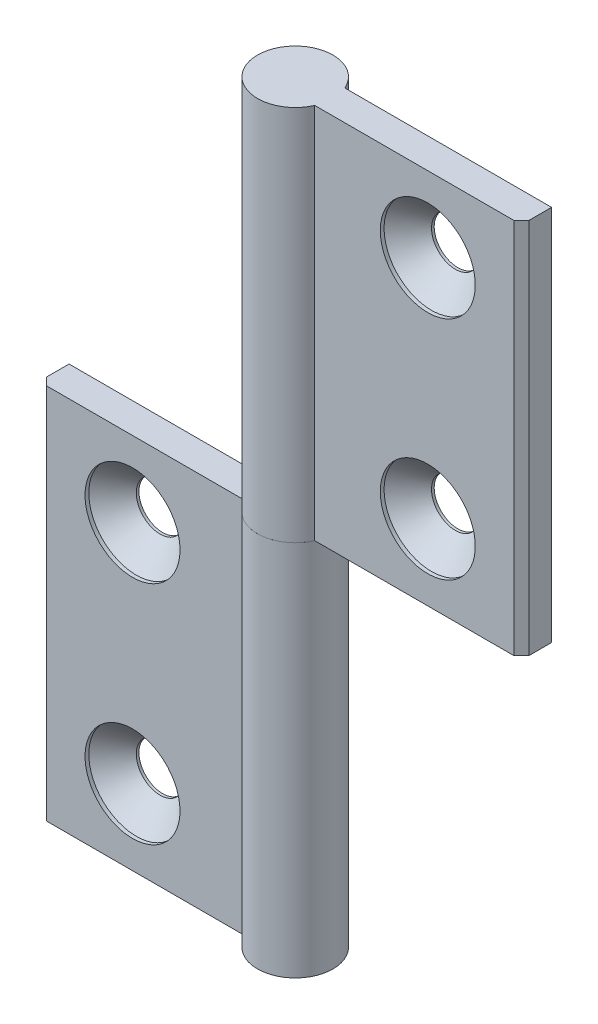
ISO-10303-21;
HEADER;
FILE_DESCRIPTION(('STEP AP214'),'2;1');
FILE_NAME('part.step','',(''),(''),'','','');
FILE_SCHEMA(('AUTOMOTIVE_DESIGN { 1 0 10303 214 1 1 1 1 }'));
ENDSEC;
DATA;
#1=APPLICATION_CONTEXT('core data for automotive mechanical design processes');
#2=APPLICATION_PROTOCOL_DEFINITION('international standard','automotive_design',2000,#1);
#3=PRODUCT_CONTEXT('',#1,'mechanical');
#4=PRODUCT('Part','Part','',(#3));
#5=PRODUCT_RELATED_PRODUCT_CATEGORY('part','',(#4));
#6=PRODUCT_DEFINITION_FORMATION('','',#4);
#7=PRODUCT_DEFINITION_CONTEXT('part definition',#1,'design');
#8=PRODUCT_DEFINITION('design','',#6,#7);
#9=PRODUCT_DEFINITION_SHAPE('','',#8);
#10=(LENGTH_UNIT() NAMED_UNIT(*) SI_UNIT(.MILLI.,.METRE.));
#11=(NAMED_UNIT(*) PLANE_ANGLE_UNIT() SI_UNIT($,.RADIAN.));
#12=(NAMED_UNIT(*) SI_UNIT($,.STERADIAN.) SOLID_ANGLE_UNIT());
#13=UNCERTAINTY_MEASURE_WITH_UNIT(LENGTH_MEASURE(1.E-05),#10,'distance_accuracy_value','');
#14=(GEOMETRIC_REPRESENTATION_CONTEXT(3) GLOBAL_UNCERTAINTY_ASSIGNED_CONTEXT((#13)) GLOBAL_UNIT_ASSIGNED_CONTEXT((#10,
#11,#12)) REPRESENTATION_CONTEXT('',''));
#15=CARTESIAN_POINT('',(0.,0.,0.));
#16=DIRECTION('',(0.,0.,1.));
#17=DIRECTION('',(1.,0.,0.));
#18=AXIS2_PLACEMENT_3D('',#15,#16,#17);
#19=CARTESIAN_POINT('',(0.,25.,0.));
#20=DIRECTION('',(0.,1.,0.));
#21=DIRECTION('',(0.,0.,-1.));
#22=AXIS2_PLACEMENT_3D('',#19,#20,#21);
#23=CYLINDRICAL_SURFACE('',#22,5.);
#24=CARTESIAN_POINT('',(0.,75.,0.));
#25=DIRECTION('',(0.,-1.,0.));
#26=DIRECTION('',(0.,0.,1.));
#27=AXIS2_PLACEMENT_3D('',#24,#25,#26);
#28=CIRCLE('',#27,5.);
#29=CARTESIAN_POINT('',(4.58257569495585,75.,1.99999999999997));
#30=VERTEX_POINT('',#29);
#31=CARTESIAN_POINT('',(4.58257569495582,75.,-2.00000000000004));
#32=VERTEX_POINT('',#31);
#33=EDGE_CURVE('E120',#30,#32,#28,.T.);
#34=ORIENTED_EDGE('',*,*,#33,.T.);
#35=DIRECTION('',(0.,1.,0.));
#36=VECTOR('',#35,1.);
#37=CARTESIAN_POINT('',(4.58257569495582,25.,-2.00000000000004));
#38=LINE('',#37,#36);
#39=CARTESIAN_POINT('',(4.58257569495582,25.,-2.00000000000004));
#40=VERTEX_POINT('',#39);
#41=EDGE_CURVE('E12',#40,#32,#38,.T.);
#42=ORIENTED_EDGE('',*,*,#41,.F.);
#43=CARTESIAN_POINT('',(0.,25.,0.));
#44=DIRECTION('',(0.,-1.,0.));
#45=DIRECTION('',(0.,0.,1.));
#46=AXIS2_PLACEMENT_3D('',#43,#44,#45);
#47=CIRCLE('',#46,5.);
#48=CARTESIAN_POINT('',(4.58257569495585,25.,1.99999999999997));
#49=VERTEX_POINT('',#48);
#50=EDGE_CURVE('E129',#49,#40,#47,.T.);
#51=ORIENTED_EDGE('',*,*,#50,.F.);
#52=DIRECTION('',(0.,1.,0.));
#53=VECTOR('',#52,1.);
#54=CARTESIAN_POINT('',(4.58257569495585,25.,1.99999999999997));
#55=LINE('',#54,#53);
#56=EDGE_CURVE('E116',#49,#30,#55,.T.);
#57=ORIENTED_EDGE('',*,*,#56,.T.);
#58=EDGE_LOOP('',(#34,#42,#51,#57));
#59=FACE_BOUND('',#58,.T.);
#60=ADVANCED_FACE('F44',(#59),#23,.T.);
#61=CARTESIAN_POINT('',(4.58257569495582,25.,-2.00000000000004));
#62=DIRECTION('',(0.,0.,1.));
#63=DIRECTION('',(-1.,0.,0.));
#64=AXIS2_PLACEMENT_3D('',#61,#62,#63);
#65=PLANE('',#64);
#66=CARTESIAN_POINT('',(19.5825756949558,35.,-2.00000000000014));
#67=DIRECTION('',(0.,0.,1.));
#68=DIRECTION('',(-1.,0.,0.));
#69=AXIS2_PLACEMENT_3D('',#66,#67,#68);
#70=CIRCLE('',#69,3.15);
#71=CARTESIAN_POINT('',(16.4325756949558,35.,-2.00000000000012));
#72=VERTEX_POINT('',#71);
#73=EDGE_CURVE('E47',#72,#72,#70,.T.);
#74=ORIENTED_EDGE('',*,*,#73,.T.);
#75=EDGE_LOOP('',(#74));
#76=FACE_BOUND('',#75,.T.);
#77=CARTESIAN_POINT('',(19.5825756949558,65.,-2.00000000000014));
#78=DIRECTION('',(0.,0.,1.));
#79=DIRECTION('',(-1.,0.,0.));
#80=AXIS2_PLACEMENT_3D('',#77,#78,#79);
#81=CIRCLE('',#80,3.15);
#82=CARTESIAN_POINT('',(16.4325756949558,65.,-2.00000000000012));
#83=VERTEX_POINT('',#82);
#84=EDGE_CURVE('E124',#83,#83,#81,.T.);
#85=ORIENTED_EDGE('',*,*,#84,.T.);
#86=EDGE_LOOP('',(#85));
#87=FACE_BOUND('',#86,.T.);
#88=DIRECTION('',(1.,0.,0.));
#89=VECTOR('',#88,1.);
#90=CARTESIAN_POINT('',(4.58257569495582,75.,-2.00000000000004));
#91=LINE('',#90,#89);
#92=CARTESIAN_POINT('',(32.,75.,-2.00000000000023));
#93=VERTEX_POINT('',#92);
#94=EDGE_CURVE('E123',#32,#93,#91,.T.);
#95=ORIENTED_EDGE('',*,*,#94,.T.);
#96=DIRECTION('',(0.,1.,0.));
#97=VECTOR('',#96,1.);
#98=CARTESIAN_POINT('',(32.,25.,-2.00000000000023));
#99=LINE('',#98,#97);
#100=CARTESIAN_POINT('',(32.,25.,-2.00000000000023));
#101=VERTEX_POINT('',#100);
#102=EDGE_CURVE('E53',#101,#93,#99,.T.);
#103=ORIENTED_EDGE('',*,*,#102,.F.);
#104=DIRECTION('',(1.,0.,0.));
#105=VECTOR('',#104,1.);
#106=CARTESIAN_POINT('',(4.58257569495582,25.,-2.00000000000004));
#107=LINE('',#106,#105);
#108=EDGE_CURVE('E96',#40,#101,#107,.T.);
#109=ORIENTED_EDGE('',*,*,#108,.F.);
#110=ORIENTED_EDGE('',*,*,#41,.T.);
#111=EDGE_LOOP('',(#95,#103,#109,#110));
#112=FACE_BOUND('',#111,.T.);
#113=ADVANCED_FACE('F150',(#76,#87,#112),#65,.F.);
#114=CARTESIAN_POINT('',(32.,25.,-2.00000000000023));
#115=DIRECTION('',(-1.,0.,0.));
#116=DIRECTION('',(0.,0.,-1.));
#117=AXIS2_PLACEMENT_3D('',#114,#115,#116);
#118=PLANE('',#117);
#119=DIRECTION('',(0.,0.,1.));
#120=VECTOR('',#119,1.);
#121=CARTESIAN_POINT('',(32.,75.,-2.00000000000023));
#122=LINE('',#121,#120);
#123=CARTESIAN_POINT('',(32.,75.,0.999999999999765));
#124=VERTEX_POINT('',#123);
#125=EDGE_CURVE('E111',#93,#124,#122,.T.);
#126=ORIENTED_EDGE('',*,*,#125,.T.);
#127=DIRECTION('',(0.,1.,0.));
#128=VECTOR('',#127,1.);
#129=CARTESIAN_POINT('',(32.,25.,0.999999999999765));
#130=LINE('',#129,#128);
#131=CARTESIAN_POINT('',(32.,25.,0.999999999999765));
#132=VERTEX_POINT('',#131);
#133=EDGE_CURVE('E108',#132,#124,#130,.T.);
#134=ORIENTED_EDGE('',*,*,#133,.F.);
#135=DIRECTION('',(0.,0.,1.));
#136=VECTOR('',#135,1.);
#137=CARTESIAN_POINT('',(32.,25.,-2.00000000000023));
#138=LINE('',#137,#136);
#139=EDGE_CURVE('E100',#101,#132,#138,.T.);
#140=ORIENTED_EDGE('',*,*,#139,.F.);
#141=ORIENTED_EDGE('',*,*,#102,.T.);
#142=EDGE_LOOP('',(#126,#134,#140,#141));
#143=FACE_BOUND('',#142,.T.);
#144=ADVANCED_FACE('F109',(#143),#118,.F.);
#145=CARTESIAN_POINT('',(32.,25.,0.999999999999765));
#146=DIRECTION('',(-0.707106781186547,0.,-0.707106781186548));
#147=DIRECTION('',(0.707106781186548,0.,-0.707106781186547));
#148=AXIS2_PLACEMENT_3D('',#145,#146,#147);
#149=PLANE('',#148);
#150=DIRECTION('',(-0.707106781186548,0.,0.707106781186547));
#151=VECTOR('',#150,1.);
#152=CARTESIAN_POINT('',(32.,75.,0.999999999999765));
#153=LINE('',#152,#151);
#154=CARTESIAN_POINT('',(31.,75.,1.99999999999977));
#155=VERTEX_POINT('',#154);
#156=EDGE_CURVE('E82',#124,#155,#153,.T.);
#157=ORIENTED_EDGE('',*,*,#156,.T.);
#158=DIRECTION('',(0.,1.,0.));
#159=VECTOR('',#158,1.);
#160=CARTESIAN_POINT('',(31.,25.,1.99999999999977));
#161=LINE('',#160,#159);
#162=CARTESIAN_POINT('',(31.,25.,1.99999999999977));
#163=VERTEX_POINT('',#162);
#164=EDGE_CURVE('E112',#163,#155,#161,.T.);
#165=ORIENTED_EDGE('',*,*,#164,.F.);
#166=DIRECTION('',(-0.707106781186548,0.,0.707106781186547));
#167=VECTOR('',#166,1.);
#168=CARTESIAN_POINT('',(32.,25.,0.999999999999765));
#169=LINE('',#168,#167);
#170=EDGE_CURVE('E104',#132,#163,#169,.T.);
#171=ORIENTED_EDGE('',*,*,#170,.F.);
#172=ORIENTED_EDGE('',*,*,#133,.T.);
#173=EDGE_LOOP('',(#157,#165,#171,#172));
#174=FACE_BOUND('',#173,.T.);
#175=ADVANCED_FACE('F114',(#174),#149,.F.);
#176=CARTESIAN_POINT('',(31.,25.,1.99999999999977));
#177=DIRECTION('',(0.,0.,-1.));
#178=DIRECTION('',(1.,0.,0.));
#179=AXIS2_PLACEMENT_3D('',#176,#177,#178);
#180=PLANE('',#179);
#181=CARTESIAN_POINT('',(19.5825756949558,35.,1.99999999999986));
#182=DIRECTION('',(0.,0.,1.));
#183=DIRECTION('',(-1.,0.,0.));
#184=AXIS2_PLACEMENT_3D('',#181,#182,#183);
#185=CIRCLE('',#184,6.3);
#186=CARTESIAN_POINT('',(13.2825756949559,35.,1.9999999999999));
#187=VERTEX_POINT('',#186);
#188=EDGE_CURVE('E184',#187,#187,#185,.T.);
#189=ORIENTED_EDGE('',*,*,#188,.F.);
#190=EDGE_LOOP('',(#189));
#191=FACE_BOUND('',#190,.T.);
#192=CARTESIAN_POINT('',(19.5825756949558,65.,1.99999999999986));
#193=DIRECTION('',(0.,0.,1.));
#194=DIRECTION('',(-1.,0.,0.));
#195=AXIS2_PLACEMENT_3D('',#192,#193,#194);
#196=CIRCLE('',#195,6.3);
#197=CARTESIAN_POINT('',(13.2825756949559,65.,1.9999999999999));
#198=VERTEX_POINT('',#197);
#199=EDGE_CURVE('E142',#198,#198,#196,.T.);
#200=ORIENTED_EDGE('',*,*,#199,.F.);
#201=EDGE_LOOP('',(#200));
#202=FACE_BOUND('',#201,.T.);
#203=DIRECTION('',(-1.,0.,0.));
#204=VECTOR('',#203,1.);
#205=CARTESIAN_POINT('',(31.,75.,1.99999999999977));
#206=LINE('',#205,#204);
#207=EDGE_CURVE('E88',#155,#30,#206,.T.);
#208=ORIENTED_EDGE('',*,*,#207,.T.);
#209=ORIENTED_EDGE('',*,*,#56,.F.);
#210=DIRECTION('',(-1.,0.,0.));
#211=VECTOR('',#210,1.);
#212=CARTESIAN_POINT('',(31.,25.,1.99999999999977));
#213=LINE('',#212,#211);
#214=EDGE_CURVE('E62',#163,#49,#213,.T.);
#215=ORIENTED_EDGE('',*,*,#214,.F.);
#216=ORIENTED_EDGE('',*,*,#164,.T.);
#217=EDGE_LOOP('',(#208,#209,#215,#216));
#218=FACE_BOUND('',#217,.T.);
#219=ADVANCED_FACE('F162',(#191,#202,#218),#180,.F.);
#220=CARTESIAN_POINT('',(0.,25.,0.));
#221=DIRECTION('',(0.,-1.,0.));
#222=DIRECTION('',(0.,0.,1.));
#223=AXIS2_PLACEMENT_3D('',#220,#221,#222);
#224=PLANE('',#223);
#225=ORIENTED_EDGE('',*,*,#50,.T.);
#226=ORIENTED_EDGE('',*,*,#108,.T.);
#227=ORIENTED_EDGE('',*,*,#139,.T.);
#228=ORIENTED_EDGE('',*,*,#170,.T.);
#229=ORIENTED_EDGE('',*,*,#214,.T.);
#230=EDGE_LOOP('',(#225,#226,#227,#228,#229));
#231=FACE_BOUND('',#230,.T.);
#232=ADVANCED_FACE('F102',(#231),#224,.T.);
#233=CARTESIAN_POINT('',(0.,75.,0.));
#234=DIRECTION('',(0.,-1.,0.));
#235=DIRECTION('',(0.,0.,1.));
#236=AXIS2_PLACEMENT_3D('',#233,#234,#235);
#237=PLANE('',#236);
#238=ORIENTED_EDGE('',*,*,#33,.F.);
#239=ORIENTED_EDGE('',*,*,#207,.F.);
#240=ORIENTED_EDGE('',*,*,#156,.F.);
#241=ORIENTED_EDGE('',*,*,#125,.F.);
#242=ORIENTED_EDGE('',*,*,#94,.F.);
#243=EDGE_LOOP('',(#238,#239,#240,#241,#242));
#244=FACE_BOUND('',#243,.T.);
#245=ADVANCED_FACE('F152',(#244),#237,.F.);
#246=CARTESIAN_POINT('',(19.5825756949558,65.,1.99999999999986));
#247=DIRECTION('',(0.,0.,1.));
#248=DIRECTION('',(-1.,0.,0.));
#249=AXIS2_PLACEMENT_3D('',#246,#247,#248);
#250=CYLINDRICAL_SURFACE('',#249,3.15);
#251=CARTESIAN_POINT('',(19.5825756949558,65.,-1.65000000000014));
#252=DIRECTION('',(0.,0.,1.));
#253=DIRECTION('',(-1.,0.,0.));
#254=AXIS2_PLACEMENT_3D('',#251,#252,#253);
#255=CIRCLE('',#254,3.15);
#256=CARTESIAN_POINT('',(16.4325756949558,65.,-1.65000000000012));
#257=VERTEX_POINT('',#256);
#258=EDGE_CURVE('E133',#257,#257,#255,.T.);
#259=ORIENTED_EDGE('',*,*,#258,.T.);
#260=EDGE_LOOP('',(#259));
#261=FACE_BOUND('',#260,.T.);
#262=ORIENTED_EDGE('',*,*,#84,.F.);
#263=EDGE_LOOP('',(#262));
#264=FACE_BOUND('',#263,.T.);
#265=ADVANCED_FACE('F154',(#261,#264),#250,.F.);
#266=CARTESIAN_POINT('',(19.5825756949558,65.,1.49999999999986));
#267=DIRECTION('',(0.,0.,1.));
#268=DIRECTION('',(-1.,0.,0.));
#269=AXIS2_PLACEMENT_3D('',#266,#267,#268);
#270=CONICAL_SURFACE('',#269,6.3,0.785398163397449);
#271=ORIENTED_EDGE('',*,*,#258,.F.);
#272=EDGE_LOOP('',(#271));
#273=FACE_BOUND('',#272,.T.);
#274=CARTESIAN_POINT('',(19.5825756949558,65.,1.49999999999986));
#275=DIRECTION('',(0.,0.,1.));
#276=DIRECTION('',(-1.,0.,0.));
#277=AXIS2_PLACEMENT_3D('',#274,#275,#276);
#278=CIRCLE('',#277,6.3);
#279=CARTESIAN_POINT('',(13.2825756949558,65.,1.4999999999999));
#280=VERTEX_POINT('',#279);
#281=EDGE_CURVE('E137',#280,#280,#278,.T.);
#282=ORIENTED_EDGE('',*,*,#281,.T.);
#283=EDGE_LOOP('',(#282));
#284=FACE_BOUND('',#283,.T.);
#285=ADVANCED_FACE('F160',(#273,#284),#270,.F.);
#286=CARTESIAN_POINT('',(19.5825756949558,65.,1.99999999999986));
#287=DIRECTION('',(0.,0.,1.));
#288=DIRECTION('',(-1.,0.,0.));
#289=AXIS2_PLACEMENT_3D('',#286,#287,#288);
#290=CYLINDRICAL_SURFACE('',#289,6.3);
#291=ORIENTED_EDGE('',*,*,#281,.F.);
#292=EDGE_LOOP('',(#291));
#293=FACE_BOUND('',#292,.T.);
#294=ORIENTED_EDGE('',*,*,#199,.T.);
#295=EDGE_LOOP('',(#294));
#296=FACE_BOUND('',#295,.T.);
#297=ADVANCED_FACE('F211',(#293,#296),#290,.F.);
#298=CARTESIAN_POINT('',(19.5825756949558,35.,1.99999999999986));
#299=DIRECTION('',(0.,0.,1.));
#300=DIRECTION('',(-1.,0.,0.));
#301=AXIS2_PLACEMENT_3D('',#298,#299,#300);
#302=CYLINDRICAL_SURFACE('',#301,3.15);
#303=CARTESIAN_POINT('',(19.5825756949558,35.,-1.65000000000014));
#304=DIRECTION('',(0.,0.,1.));
#305=DIRECTION('',(-1.,0.,0.));
#306=AXIS2_PLACEMENT_3D('',#303,#304,#305);
#307=CIRCLE('',#306,3.15);
#308=CARTESIAN_POINT('',(16.4325756949558,35.,-1.65000000000012));
#309=VERTEX_POINT('',#308);
#310=EDGE_CURVE('E188',#309,#309,#307,.T.);
#311=ORIENTED_EDGE('',*,*,#310,.T.);
#312=EDGE_LOOP('',(#311));
#313=FACE_BOUND('',#312,.T.);
#314=ORIENTED_EDGE('',*,*,#73,.F.);
#315=EDGE_LOOP('',(#314));
#316=FACE_BOUND('',#315,.T.);
#317=ADVANCED_FACE('F204',(#313,#316),#302,.F.);
#318=CARTESIAN_POINT('',(19.5825756949558,35.,1.49999999999986));
#319=DIRECTION('',(0.,0.,1.));
#320=DIRECTION('',(-1.,0.,0.));
#321=AXIS2_PLACEMENT_3D('',#318,#319,#320);
#322=CONICAL_SURFACE('',#321,6.3,0.785398163397449);
#323=ORIENTED_EDGE('',*,*,#310,.F.);
#324=EDGE_LOOP('',(#323));
#325=FACE_BOUND('',#324,.T.);
#326=CARTESIAN_POINT('',(19.5825756949558,35.,1.49999999999986));
#327=DIRECTION('',(0.,0.,1.));
#328=DIRECTION('',(-1.,0.,0.));
#329=AXIS2_PLACEMENT_3D('',#326,#327,#328);
#330=CIRCLE('',#329,6.3);
#331=CARTESIAN_POINT('',(13.2825756949558,35.,1.4999999999999));
#332=VERTEX_POINT('',#331);
#333=EDGE_CURVE('E192',#332,#332,#330,.T.);
#334=ORIENTED_EDGE('',*,*,#333,.T.);
#335=EDGE_LOOP('',(#334));
#336=FACE_BOUND('',#335,.T.);
#337=ADVANCED_FACE('F198',(#325,#336),#322,.F.);
#338=CARTESIAN_POINT('',(19.5825756949558,35.,1.99999999999986));
#339=DIRECTION('',(0.,0.,1.));
#340=DIRECTION('',(-1.,0.,0.));
#341=AXIS2_PLACEMENT_3D('',#338,#339,#340);
#342=CYLINDRICAL_SURFACE('',#341,6.3);
#343=ORIENTED_EDGE('',*,*,#333,.F.);
#344=EDGE_LOOP('',(#343));
#345=FACE_BOUND('',#344,.T.);
#346=ORIENTED_EDGE('',*,*,#188,.T.);
#347=EDGE_LOOP('',(#346));
#348=FACE_BOUND('',#347,.T.);
#349=ADVANCED_FACE('F196',(#345,#348),#342,.F.);
#350=CLOSED_SHELL('',(#60,#113,#144,#175,#219,#232,#245,#265,#285,#297,#317,#337,#349));
#351=MANIFOLD_SOLID_BREP('B2',#350);
#352=CARTESIAN_POINT('',(0.,25.,0.));
#353=DIRECTION('',(0.,-1.,0.));
#354=DIRECTION('',(0.,0.,-1.));
#355=AXIS2_PLACEMENT_3D('',#352,#353,#354);
#356=CYLINDRICAL_SURFACE('',#355,5.);
#357=CARTESIAN_POINT('',(0.,-25.,0.));
#358=DIRECTION('',(0.,1.,0.));
#359=DIRECTION('',(0.,0.,1.));
#360=AXIS2_PLACEMENT_3D('',#357,#358,#359);
#361=CIRCLE('',#360,5.);
#362=CARTESIAN_POINT('',(-4.58257569495584,-25.,2.));
#363=VERTEX_POINT('',#362);
#364=CARTESIAN_POINT('',(-4.58257569495584,-25.,-2.));
#365=VERTEX_POINT('',#364);
#366=EDGE_CURVE('E371',#363,#365,#361,.T.);
#367=ORIENTED_EDGE('',*,*,#366,.T.);
#368=DIRECTION('',(0.,-1.,0.));
#369=VECTOR('',#368,1.);
#370=CARTESIAN_POINT('',(-4.58257569495584,25.,-2.));
#371=LINE('',#370,#369);
#372=CARTESIAN_POINT('',(-4.58257569495584,25.,-2.));
#373=VERTEX_POINT('',#372);
#374=EDGE_CURVE('E42',#373,#365,#371,.T.);
#375=ORIENTED_EDGE('',*,*,#374,.F.);
#376=CARTESIAN_POINT('',(0.,25.,0.));
#377=DIRECTION('',(0.,1.,0.));
#378=DIRECTION('',(0.,0.,1.));
#379=AXIS2_PLACEMENT_3D('',#376,#377,#378);
#380=CIRCLE('',#379,5.);
#381=CARTESIAN_POINT('',(-4.58257569495584,25.,2.));
#382=VERTEX_POINT('',#381);
#383=EDGE_CURVE('E380',#382,#373,#380,.T.);
#384=ORIENTED_EDGE('',*,*,#383,.F.);
#385=DIRECTION('',(0.,-1.,0.));
#386=VECTOR('',#385,1.);
#387=CARTESIAN_POINT('',(-4.58257569495584,25.,2.));
#388=LINE('',#387,#386);
#389=EDGE_CURVE('E367',#382,#363,#388,.T.);
#390=ORIENTED_EDGE('',*,*,#389,.T.);
#391=EDGE_LOOP('',(#367,#375,#384,#390));
#392=FACE_BOUND('',#391,.T.);
#393=ADVANCED_FACE('F295',(#392),#356,.T.);
#394=CARTESIAN_POINT('',(-4.58257569495584,25.,-2.));
#395=DIRECTION('',(0.,0.,1.));
#396=DIRECTION('',(1.,0.,0.));
#397=AXIS2_PLACEMENT_3D('',#394,#395,#396);
#398=PLANE('',#397);
#399=CARTESIAN_POINT('',(-19.5825756949558,15.,-2.));
#400=DIRECTION('',(0.,0.,1.));
#401=DIRECTION('',(1.,0.,0.));
#402=AXIS2_PLACEMENT_3D('',#399,#400,#401);
#403=CIRCLE('',#402,3.15);
#404=CARTESIAN_POINT('',(-16.4325756949558,15.,-2.));
#405=VERTEX_POINT('',#404);
#406=EDGE_CURVE('E298',#405,#405,#403,.T.);
#407=ORIENTED_EDGE('',*,*,#406,.T.);
#408=EDGE_LOOP('',(#407));
#409=FACE_BOUND('',#408,.T.);
#410=CARTESIAN_POINT('',(-19.5825756949558,-15.,-2.));
#411=DIRECTION('',(0.,0.,1.));
#412=DIRECTION('',(1.,0.,0.));
#413=AXIS2_PLACEMENT_3D('',#410,#411,#412);
#414=CIRCLE('',#413,3.15);
#415=CARTESIAN_POINT('',(-16.4325756949558,-15.,-2.));
#416=VERTEX_POINT('',#415);
#417=EDGE_CURVE('E375',#416,#416,#414,.T.);
#418=ORIENTED_EDGE('',*,*,#417,.T.);
#419=EDGE_LOOP('',(#418));
#420=FACE_BOUND('',#419,.T.);
#421=DIRECTION('',(-1.,0.,0.));
#422=VECTOR('',#421,1.);
#423=CARTESIAN_POINT('',(-4.58257569495584,-25.,-2.));
#424=LINE('',#423,#422);
#425=CARTESIAN_POINT('',(-32.,-25.,-2.));
#426=VERTEX_POINT('',#425);
#427=EDGE_CURVE('E374',#365,#426,#424,.T.);
#428=ORIENTED_EDGE('',*,*,#427,.T.);
#429=DIRECTION('',(0.,-1.,0.));
#430=VECTOR('',#429,1.);
#431=CARTESIAN_POINT('',(-32.,25.,-2.));
#432=LINE('',#431,#430);
#433=CARTESIAN_POINT('',(-32.,25.,-2.));
#434=VERTEX_POINT('',#433);
#435=EDGE_CURVE('E304',#434,#426,#432,.T.);
#436=ORIENTED_EDGE('',*,*,#435,.F.);
#437=DIRECTION('',(-1.,0.,0.));
#438=VECTOR('',#437,1.);
#439=CARTESIAN_POINT('',(-4.58257569495584,25.,-2.));
#440=LINE('',#439,#438);
#441=EDGE_CURVE('E347',#373,#434,#440,.T.);
#442=ORIENTED_EDGE('',*,*,#441,.F.);
#443=ORIENTED_EDGE('',*,*,#374,.T.);
#444=EDGE_LOOP('',(#428,#436,#442,#443));
#445=FACE_BOUND('',#444,.T.);
#446=ADVANCED_FACE('F401',(#409,#420,#445),#398,.F.);
#447=CARTESIAN_POINT('',(-32.,25.,-2.));
#448=DIRECTION('',(1.,0.,0.));
#449=DIRECTION('',(0.,0.,-1.));
#450=AXIS2_PLACEMENT_3D('',#447,#448,#449);
#451=PLANE('',#450);
#452=DIRECTION('',(0.,0.,1.));
#453=VECTOR('',#452,1.);
#454=CARTESIAN_POINT('',(-32.,-25.,-2.));
#455=LINE('',#454,#453);
#456=CARTESIAN_POINT('',(-32.,-25.,1.));
#457=VERTEX_POINT('',#456);
#458=EDGE_CURVE('E362',#426,#457,#455,.T.);
#459=ORIENTED_EDGE('',*,*,#458,.T.);
#460=DIRECTION('',(0.,-1.,0.));
#461=VECTOR('',#460,1.);
#462=CARTESIAN_POINT('',(-32.,25.,1.));
#463=LINE('',#462,#461);
#464=CARTESIAN_POINT('',(-32.,25.,1.));
#465=VERTEX_POINT('',#464);
#466=EDGE_CURVE('E359',#465,#457,#463,.T.);
#467=ORIENTED_EDGE('',*,*,#466,.F.);
#468=DIRECTION('',(0.,0.,1.));
#469=VECTOR('',#468,1.);
#470=CARTESIAN_POINT('',(-32.,25.,-2.));
#471=LINE('',#470,#469);
#472=EDGE_CURVE('E351',#434,#465,#471,.T.);
#473=ORIENTED_EDGE('',*,*,#472,.F.);
#474=ORIENTED_EDGE('',*,*,#435,.T.);
#475=EDGE_LOOP('',(#459,#467,#473,#474));
#476=FACE_BOUND('',#475,.T.);
#477=ADVANCED_FACE('F360',(#476),#451,.F.);
#478=CARTESIAN_POINT('',(-32.,25.,1.));
#479=DIRECTION('',(0.707106781186542,0.,-0.707106781186553));
#480=DIRECTION('',(-0.707106781186553,0.,-0.707106781186542));
#481=AXIS2_PLACEMENT_3D('',#478,#479,#480);
#482=PLANE('',#481);
#483=DIRECTION('',(0.707106781186553,0.,0.707106781186542));
#484=VECTOR('',#483,1.);
#485=CARTESIAN_POINT('',(-32.,-25.,1.));
#486=LINE('',#485,#484);
#487=CARTESIAN_POINT('',(-31.,-25.,2.));
#488=VERTEX_POINT('',#487);
#489=EDGE_CURVE('E333',#457,#488,#486,.T.);
#490=ORIENTED_EDGE('',*,*,#489,.T.);
#491=DIRECTION('',(0.,-1.,0.));
#492=VECTOR('',#491,1.);
#493=CARTESIAN_POINT('',(-31.,25.,2.));
#494=LINE('',#493,#492);
#495=CARTESIAN_POINT('',(-31.,25.,2.));
#496=VERTEX_POINT('',#495);
#497=EDGE_CURVE('E363',#496,#488,#494,.T.);
#498=ORIENTED_EDGE('',*,*,#497,.F.);
#499=DIRECTION('',(0.707106781186553,0.,0.707106781186542));
#500=VECTOR('',#499,1.);
#501=CARTESIAN_POINT('',(-32.,25.,1.));
#502=LINE('',#501,#500);
#503=EDGE_CURVE('E355',#465,#496,#502,.T.);
#504=ORIENTED_EDGE('',*,*,#503,.F.);
#505=ORIENTED_EDGE('',*,*,#466,.T.);
#506=EDGE_LOOP('',(#490,#498,#504,#505));
#507=FACE_BOUND('',#506,.T.);
#508=ADVANCED_FACE('F365',(#507),#482,.F.);
#509=CARTESIAN_POINT('',(-31.,25.,2.));
#510=DIRECTION('',(0.,0.,-1.));
#511=DIRECTION('',(-1.,0.,0.));
#512=AXIS2_PLACEMENT_3D('',#509,#510,#511);
#513=PLANE('',#512);
#514=CARTESIAN_POINT('',(-19.5825756949558,15.,2.));
#515=DIRECTION('',(0.,0.,1.));
#516=DIRECTION('',(1.,0.,0.));
#517=AXIS2_PLACEMENT_3D('',#514,#515,#516);
#518=CIRCLE('',#517,6.3);
#519=CARTESIAN_POINT('',(-13.2825756949558,15.,2.));
#520=VERTEX_POINT('',#519);
#521=EDGE_CURVE('E435',#520,#520,#518,.T.);
#522=ORIENTED_EDGE('',*,*,#521,.F.);
#523=EDGE_LOOP('',(#522));
#524=FACE_BOUND('',#523,.T.);
#525=CARTESIAN_POINT('',(-19.5825756949558,-15.,2.));
#526=DIRECTION('',(0.,0.,1.));
#527=DIRECTION('',(1.,0.,0.));
#528=AXIS2_PLACEMENT_3D('',#525,#526,#527);
#529=CIRCLE('',#528,6.3);
#530=CARTESIAN_POINT('',(-13.2825756949558,-15.,2.));
#531=VERTEX_POINT('',#530);
#532=EDGE_CURVE('E393',#531,#531,#529,.T.);
#533=ORIENTED_EDGE('',*,*,#532,.F.);
#534=EDGE_LOOP('',(#533));
#535=FACE_BOUND('',#534,.T.);
#536=DIRECTION('',(1.,0.,0.));
#537=VECTOR('',#536,1.);
#538=CARTESIAN_POINT('',(-31.,-25.,2.));
#539=LINE('',#538,#537);
#540=EDGE_CURVE('E339',#488,#363,#539,.T.);
#541=ORIENTED_EDGE('',*,*,#540,.T.);
#542=ORIENTED_EDGE('',*,*,#389,.F.);
#543=DIRECTION('',(1.,0.,0.));
#544=VECTOR('',#543,1.);
#545=CARTESIAN_POINT('',(-31.,25.,2.));
#546=LINE('',#545,#544);
#547=EDGE_CURVE('E313',#496,#382,#546,.T.);
#548=ORIENTED_EDGE('',*,*,#547,.F.);
#549=ORIENTED_EDGE('',*,*,#497,.T.);
#550=EDGE_LOOP('',(#541,#542,#548,#549));
#551=FACE_BOUND('',#550,.T.);
#552=ADVANCED_FACE('F413',(#524,#535,#551),#513,.F.);
#553=CARTESIAN_POINT('',(0.,25.,0.));
#554=DIRECTION('',(0.,1.,0.));
#555=DIRECTION('',(0.,0.,1.));
#556=AXIS2_PLACEMENT_3D('',#553,#554,#555);
#557=PLANE('',#556);
#558=ORIENTED_EDGE('',*,*,#383,.T.);
#559=ORIENTED_EDGE('',*,*,#441,.T.);
#560=ORIENTED_EDGE('',*,*,#472,.T.);
#561=ORIENTED_EDGE('',*,*,#503,.T.);
#562=ORIENTED_EDGE('',*,*,#547,.T.);
#563=EDGE_LOOP('',(#558,#559,#560,#561,#562));
#564=FACE_BOUND('',#563,.T.);
#565=ADVANCED_FACE('F353',(#564),#557,.T.);
#566=CARTESIAN_POINT('',(0.,-25.,0.));
#567=DIRECTION('',(0.,1.,0.));
#568=DIRECTION('',(0.,0.,1.));
#569=AXIS2_PLACEMENT_3D('',#566,#567,#568);
#570=PLANE('',#569);
#571=ORIENTED_EDGE('',*,*,#366,.F.);
#572=ORIENTED_EDGE('',*,*,#540,.F.);
#573=ORIENTED_EDGE('',*,*,#489,.F.);
#574=ORIENTED_EDGE('',*,*,#458,.F.);
#575=ORIENTED_EDGE('',*,*,#427,.F.);
#576=EDGE_LOOP('',(#571,#572,#573,#574,#575));
#577=FACE_BOUND('',#576,.T.);
#578=ADVANCED_FACE('F403',(#577),#570,.F.);
#579=CARTESIAN_POINT('',(-19.5825756949558,-15.,2.));
#580=DIRECTION('',(0.,0.,1.));
#581=DIRECTION('',(1.,0.,0.));
#582=AXIS2_PLACEMENT_3D('',#579,#580,#581);
#583=CYLINDRICAL_SURFACE('',#582,3.15);
#584=CARTESIAN_POINT('',(-19.5825756949558,-15.,-1.65));
#585=DIRECTION('',(0.,0.,1.));
#586=DIRECTION('',(1.,0.,0.));
#587=AXIS2_PLACEMENT_3D('',#584,#585,#586);
#588=CIRCLE('',#587,3.15);
#589=CARTESIAN_POINT('',(-16.4325756949558,-15.,-1.65));
#590=VERTEX_POINT('',#589);
#591=EDGE_CURVE('E384',#590,#590,#588,.T.);
#592=ORIENTED_EDGE('',*,*,#591,.T.);
#593=EDGE_LOOP('',(#592));
#594=FACE_BOUND('',#593,.T.);
#595=ORIENTED_EDGE('',*,*,#417,.F.);
#596=EDGE_LOOP('',(#595));
#597=FACE_BOUND('',#596,.T.);
#598=ADVANCED_FACE('F405',(#594,#597),#583,.F.);
#599=CARTESIAN_POINT('',(-19.5825756949558,-15.,1.5));
#600=DIRECTION('',(0.,0.,1.));
#601=DIRECTION('',(1.,0.,0.));
#602=AXIS2_PLACEMENT_3D('',#599,#600,#601);
#603=CONICAL_SURFACE('',#602,6.3,0.785398163397449);
#604=ORIENTED_EDGE('',*,*,#591,.F.);
#605=EDGE_LOOP('',(#604));
#606=FACE_BOUND('',#605,.T.);
#607=CARTESIAN_POINT('',(-19.5825756949558,-15.,1.5));
#608=DIRECTION('',(0.,0.,1.));
#609=DIRECTION('',(1.,0.,0.));
#610=AXIS2_PLACEMENT_3D('',#607,#608,#609);
#611=CIRCLE('',#610,6.3);
#612=CARTESIAN_POINT('',(-13.2825756949558,-15.,1.5));
#613=VERTEX_POINT('',#612);
#614=EDGE_CURVE('E388',#613,#613,#611,.T.);
#615=ORIENTED_EDGE('',*,*,#614,.T.);
#616=EDGE_LOOP('',(#615));
#617=FACE_BOUND('',#616,.T.);
#618=ADVANCED_FACE('F411',(#606,#617),#603,.F.);
#619=CARTESIAN_POINT('',(-19.5825756949558,-15.,2.));
#620=DIRECTION('',(0.,0.,1.));
#621=DIRECTION('',(1.,0.,0.));
#622=AXIS2_PLACEMENT_3D('',#619,#620,#621);
#623=CYLINDRICAL_SURFACE('',#622,6.3);
#624=ORIENTED_EDGE('',*,*,#614,.F.);
#625=EDGE_LOOP('',(#624));
#626=FACE_BOUND('',#625,.T.);
#627=ORIENTED_EDGE('',*,*,#532,.T.);
#628=EDGE_LOOP('',(#627));
#629=FACE_BOUND('',#628,.T.);
#630=ADVANCED_FACE('F462',(#626,#629),#623,.F.);
#631=CARTESIAN_POINT('',(-19.5825756949558,15.,2.));
#632=DIRECTION('',(0.,0.,1.));
#633=DIRECTION('',(1.,0.,0.));
#634=AXIS2_PLACEMENT_3D('',#631,#632,#633);
#635=CYLINDRICAL_SURFACE('',#634,3.15);
#636=CARTESIAN_POINT('',(-19.5825756949558,15.,-1.65));
#637=DIRECTION('',(0.,0.,1.));
#638=DIRECTION('',(1.,0.,0.));
#639=AXIS2_PLACEMENT_3D('',#636,#637,#638);
#640=CIRCLE('',#639,3.15);
#641=CARTESIAN_POINT('',(-16.4325756949558,15.,-1.65));
#642=VERTEX_POINT('',#641);
#643=EDGE_CURVE('E439',#642,#642,#640,.T.);
#644=ORIENTED_EDGE('',*,*,#643,.T.);
#645=EDGE_LOOP('',(#644));
#646=FACE_BOUND('',#645,.T.);
#647=ORIENTED_EDGE('',*,*,#406,.F.);
#648=EDGE_LOOP('',(#647));
#649=FACE_BOUND('',#648,.T.);
#650=ADVANCED_FACE('F455',(#646,#649),#635,.F.);
#651=CARTESIAN_POINT('',(-19.5825756949558,15.,1.5));
#652=DIRECTION('',(0.,0.,1.));
#653=DIRECTION('',(1.,0.,0.));
#654=AXIS2_PLACEMENT_3D('',#651,#652,#653);
#655=CONICAL_SURFACE('',#654,6.3,0.785398163397449);
#656=ORIENTED_EDGE('',*,*,#643,.F.);
#657=EDGE_LOOP('',(#656));
#658=FACE_BOUND('',#657,.T.);
#659=CARTESIAN_POINT('',(-19.5825756949558,15.,1.5));
#660=DIRECTION('',(0.,0.,1.));
#661=DIRECTION('',(1.,0.,0.));
#662=AXIS2_PLACEMENT_3D('',#659,#660,#661);
#663=CIRCLE('',#662,6.3);
#664=CARTESIAN_POINT('',(-13.2825756949558,15.,1.5));
#665=VERTEX_POINT('',#664);
#666=EDGE_CURVE('E443',#665,#665,#663,.T.);
#667=ORIENTED_EDGE('',*,*,#666,.T.);
#668=EDGE_LOOP('',(#667));
#669=FACE_BOUND('',#668,.T.);
#670=ADVANCED_FACE('F449',(#658,#669),#655,.F.);
#671=CARTESIAN_POINT('',(-19.5825756949558,15.,2.));
#672=DIRECTION('',(0.,0.,1.));
#673=DIRECTION('',(1.,0.,0.));
#674=AXIS2_PLACEMENT_3D('',#671,#672,#673);
#675=CYLINDRICAL_SURFACE('',#674,6.3);
#676=ORIENTED_EDGE('',*,*,#666,.F.);
#677=EDGE_LOOP('',(#676));
#678=FACE_BOUND('',#677,.T.);
#679=ORIENTED_EDGE('',*,*,#521,.T.);
#680=EDGE_LOOP('',(#679));
#681=FACE_BOUND('',#680,.T.);
#682=ADVANCED_FACE('F447',(#678,#681),#675,.F.);
#683=CLOSED_SHELL('',(#393,#446,#477,#508,#552,#565,#578,#598,#618,#630,#650,#670,#682));
#684=MANIFOLD_SOLID_BREP('B6',#683);
#685=ADVANCED_BREP_SHAPE_REPRESENTATION('',(#18,#351,#684),#14);
#686=SHAPE_DEFINITION_REPRESENTATION(#9,#685);
ENDSEC;
END-ISO-10303-21;
